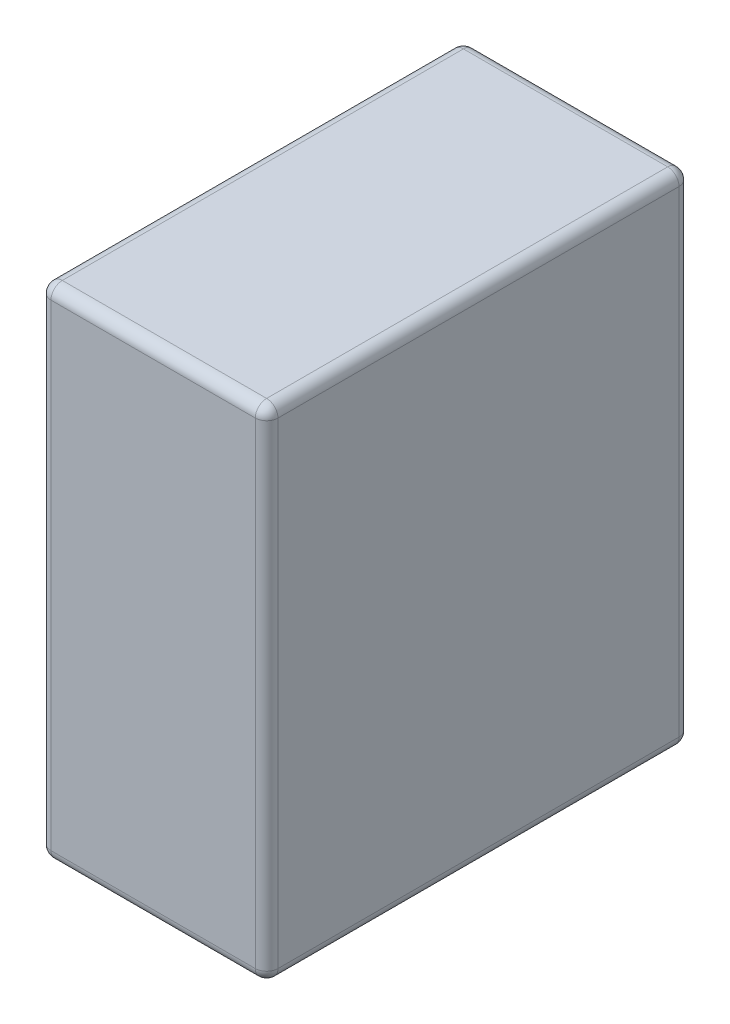
ISO-10303-21;
HEADER;
FILE_DESCRIPTION(('STEP AP214'),'2;1');
FILE_NAME('part.step','',(''),(''),'','','');
FILE_SCHEMA(('AUTOMOTIVE_DESIGN { 1 0 10303 214 1 1 1 1 }'));
ENDSEC;
DATA;
#1=APPLICATION_CONTEXT('core data for automotive mechanical design processes');
#2=APPLICATION_PROTOCOL_DEFINITION('international standard','automotive_design',2000,#1);
#3=PRODUCT_CONTEXT('',#1,'mechanical');
#4=PRODUCT('Part','Part','',(#3));
#5=PRODUCT_RELATED_PRODUCT_CATEGORY('part','',(#4));
#6=PRODUCT_DEFINITION_FORMATION('','',#4);
#7=PRODUCT_DEFINITION_CONTEXT('part definition',#1,'design');
#8=PRODUCT_DEFINITION('design','',#6,#7);
#9=PRODUCT_DEFINITION_SHAPE('','',#8);
#10=(LENGTH_UNIT() NAMED_UNIT(*) SI_UNIT(.MILLI.,.METRE.));
#11=(NAMED_UNIT(*) PLANE_ANGLE_UNIT() SI_UNIT($,.RADIAN.));
#12=(NAMED_UNIT(*) SI_UNIT($,.STERADIAN.) SOLID_ANGLE_UNIT());
#13=UNCERTAINTY_MEASURE_WITH_UNIT(LENGTH_MEASURE(1.E-05),#10,'distance_accuracy_value','');
#14=(GEOMETRIC_REPRESENTATION_CONTEXT(3) GLOBAL_UNCERTAINTY_ASSIGNED_CONTEXT((#13)) GLOBAL_UNIT_ASSIGNED_CONTEXT((#10,
#11,#12)) REPRESENTATION_CONTEXT('',''));
#15=CARTESIAN_POINT('',(0.,0.,0.));
#16=DIRECTION('',(0.,0.,1.));
#17=DIRECTION('',(1.,0.,0.));
#18=AXIS2_PLACEMENT_3D('',#15,#16,#17);
#19=CARTESIAN_POINT('',(-15.,66.,28.));
#20=DIRECTION('',(1.,0.,0.));
#21=DIRECTION('',(0.,0.,-1.));
#22=AXIS2_PLACEMENT_3D('',#19,#20,#21);
#23=PLANE('',#22);
#24=DIRECTION('',(0.,-1.,0.));
#25=VECTOR('',#24,1.);
#26=CARTESIAN_POINT('',(-15.,66.,-26.5));
#27=LINE('',#26,#25);
#28=CARTESIAN_POINT('',(-15.,64.5,-26.5));
#29=VERTEX_POINT('',#28);
#30=CARTESIAN_POINT('',(-15.,1.5,-26.5));
#31=VERTEX_POINT('',#30);
#32=EDGE_CURVE('E144',#29,#31,#27,.T.);
#33=ORIENTED_EDGE('',*,*,#32,.T.);
#34=DIRECTION('',(0.,0.,1.));
#35=VECTOR('',#34,1.);
#36=CARTESIAN_POINT('',(-15.,1.5,28.));
#37=LINE('',#36,#35);
#38=CARTESIAN_POINT('',(-15.,1.5,26.5));
#39=VERTEX_POINT('',#38);
#40=EDGE_CURVE('E139',#31,#39,#37,.T.);
#41=ORIENTED_EDGE('',*,*,#40,.T.);
#42=DIRECTION('',(0.,-1.,0.));
#43=VECTOR('',#42,1.);
#44=CARTESIAN_POINT('',(-15.,66.,26.5));
#45=LINE('',#44,#43);
#46=CARTESIAN_POINT('',(-15.,64.5,26.5));
#47=VERTEX_POINT('',#46);
#48=EDGE_CURVE('E134',#39,#47,#45,.F.);
#49=ORIENTED_EDGE('',*,*,#48,.T.);
#50=DIRECTION('',(0.,0.,1.));
#51=VECTOR('',#50,1.);
#52=CARTESIAN_POINT('',(-15.,64.5,-28.));
#53=LINE('',#52,#51);
#54=EDGE_CURVE('E136',#47,#29,#53,.F.);
#55=ORIENTED_EDGE('',*,*,#54,.T.);
#56=EDGE_LOOP('',(#33,#41,#49,#55));
#57=FACE_BOUND('',#56,.T.);
#58=ADVANCED_FACE('F45',(#57),#23,.F.);
#59=CARTESIAN_POINT('',(15.,66.,28.));
#60=DIRECTION('',(0.,0.,-1.));
#61=DIRECTION('',(-1.,0.,0.));
#62=AXIS2_PLACEMENT_3D('',#59,#60,#61);
#63=PLANE('',#62);
#64=DIRECTION('',(0.,-1.,0.));
#65=VECTOR('',#64,1.);
#66=CARTESIAN_POINT('',(-13.5,66.,28.));
#67=LINE('',#66,#65);
#68=CARTESIAN_POINT('',(-13.5,64.5,28.));
#69=VERTEX_POINT('',#68);
#70=CARTESIAN_POINT('',(-13.5,1.5,28.));
#71=VERTEX_POINT('',#70);
#72=EDGE_CURVE('E168',#69,#71,#67,.T.);
#73=ORIENTED_EDGE('',*,*,#72,.T.);
#74=DIRECTION('',(1.,0.,0.));
#75=VECTOR('',#74,1.);
#76=CARTESIAN_POINT('',(15.,1.5,28.));
#77=LINE('',#76,#75);
#78=CARTESIAN_POINT('',(13.5,1.5,28.));
#79=VERTEX_POINT('',#78);
#80=EDGE_CURVE('E269',#71,#79,#77,.T.);
#81=ORIENTED_EDGE('',*,*,#80,.T.);
#82=DIRECTION('',(0.,-1.,0.));
#83=VECTOR('',#82,1.);
#84=CARTESIAN_POINT('',(13.5,66.,28.));
#85=LINE('',#84,#83);
#86=CARTESIAN_POINT('',(13.5,64.5,28.));
#87=VERTEX_POINT('',#86);
#88=EDGE_CURVE('E260',#79,#87,#85,.F.);
#89=ORIENTED_EDGE('',*,*,#88,.T.);
#90=DIRECTION('',(1.,0.,0.));
#91=VECTOR('',#90,1.);
#92=CARTESIAN_POINT('',(-15.,64.5,28.));
#93=LINE('',#92,#91);
#94=EDGE_CURVE('E256',#87,#69,#93,.F.);
#95=ORIENTED_EDGE('',*,*,#94,.T.);
#96=EDGE_LOOP('',(#73,#81,#89,#95));
#97=FACE_BOUND('',#96,.T.);
#98=ADVANCED_FACE('F380',(#97),#63,.F.);
#99=CARTESIAN_POINT('',(15.,66.,28.));
#100=DIRECTION('',(-1.,0.,0.));
#101=DIRECTION('',(0.,0.,1.));
#102=AXIS2_PLACEMENT_3D('',#99,#100,#101);
#103=PLANE('',#102);
#104=DIRECTION('',(0.,0.,-1.));
#105=VECTOR('',#104,1.);
#106=CARTESIAN_POINT('',(15.,1.5,28.));
#107=LINE('',#106,#105);
#108=CARTESIAN_POINT('',(15.,1.5,26.5));
#109=VERTEX_POINT('',#108);
#110=CARTESIAN_POINT('',(15.,1.5,-26.5));
#111=VERTEX_POINT('',#110);
#112=EDGE_CURVE('E251',#109,#111,#107,.T.);
#113=ORIENTED_EDGE('',*,*,#112,.T.);
#114=DIRECTION('',(0.,-1.,0.));
#115=VECTOR('',#114,1.);
#116=CARTESIAN_POINT('',(15.,66.,-26.5));
#117=LINE('',#116,#115);
#118=CARTESIAN_POINT('',(15.,64.5,-26.5));
#119=VERTEX_POINT('',#118);
#120=EDGE_CURVE('E248',#111,#119,#117,.F.);
#121=ORIENTED_EDGE('',*,*,#120,.T.);
#122=DIRECTION('',(0.,0.,-1.));
#123=VECTOR('',#122,1.);
#124=CARTESIAN_POINT('',(15.,64.5,28.));
#125=LINE('',#124,#123);
#126=CARTESIAN_POINT('',(15.,64.5,26.5));
#127=VERTEX_POINT('',#126);
#128=EDGE_CURVE('E240',#119,#127,#125,.F.);
#129=ORIENTED_EDGE('',*,*,#128,.T.);
#130=DIRECTION('',(0.,-1.,0.));
#131=VECTOR('',#130,1.);
#132=CARTESIAN_POINT('',(15.,66.,26.5));
#133=LINE('',#132,#131);
#134=EDGE_CURVE('E244',#127,#109,#133,.T.);
#135=ORIENTED_EDGE('',*,*,#134,.T.);
#136=EDGE_LOOP('',(#113,#121,#129,#135));
#137=FACE_BOUND('',#136,.T.);
#138=ADVANCED_FACE('F249',(#137),#103,.F.);
#139=CARTESIAN_POINT('',(15.,66.,-28.));
#140=DIRECTION('',(0.,0.,1.));
#141=DIRECTION('',(1.,0.,0.));
#142=AXIS2_PLACEMENT_3D('',#139,#140,#141);
#143=PLANE('',#142);
#144=DIRECTION('',(-1.,0.,0.));
#145=VECTOR('',#144,1.);
#146=CARTESIAN_POINT('',(15.,1.5,-28.));
#147=LINE('',#146,#145);
#148=CARTESIAN_POINT('',(13.5,1.5,-28.));
#149=VERTEX_POINT('',#148);
#150=CARTESIAN_POINT('',(-13.5,1.5,-28.));
#151=VERTEX_POINT('',#150);
#152=EDGE_CURVE('E332',#149,#151,#147,.T.);
#153=ORIENTED_EDGE('',*,*,#152,.T.);
#154=DIRECTION('',(0.,-1.,0.));
#155=VECTOR('',#154,1.);
#156=CARTESIAN_POINT('',(-13.5,66.,-28.));
#157=LINE('',#156,#155);
#158=CARTESIAN_POINT('',(-13.5,64.5,-28.));
#159=VERTEX_POINT('',#158);
#160=EDGE_CURVE('E245',#151,#159,#157,.F.);
#161=ORIENTED_EDGE('',*,*,#160,.T.);
#162=DIRECTION('',(-1.,0.,0.));
#163=VECTOR('',#162,1.);
#164=CARTESIAN_POINT('',(15.,64.5,-28.));
#165=LINE('',#164,#163);
#166=CARTESIAN_POINT('',(13.5,64.5,-28.));
#167=VERTEX_POINT('',#166);
#168=EDGE_CURVE('E323',#159,#167,#165,.F.);
#169=ORIENTED_EDGE('',*,*,#168,.T.);
#170=DIRECTION('',(0.,-1.,0.));
#171=VECTOR('',#170,1.);
#172=CARTESIAN_POINT('',(13.5,66.,-28.));
#173=LINE('',#172,#171);
#174=EDGE_CURVE('E326',#167,#149,#173,.T.);
#175=ORIENTED_EDGE('',*,*,#174,.T.);
#176=EDGE_LOOP('',(#153,#161,#169,#175));
#177=FACE_BOUND('',#176,.T.);
#178=ADVANCED_FACE('F364',(#177),#143,.F.);
#179=CARTESIAN_POINT('',(0.,66.,0.));
#180=DIRECTION('',(0.,1.,0.));
#181=DIRECTION('',(0.,0.,1.));
#182=AXIS2_PLACEMENT_3D('',#179,#180,#181);
#183=PLANE('',#182);
#184=DIRECTION('',(0.,0.,-1.));
#185=VECTOR('',#184,1.);
#186=CARTESIAN_POINT('',(13.5,66.,-28.));
#187=LINE('',#186,#185);
#188=CARTESIAN_POINT('',(13.5,66.,26.5));
#189=VERTEX_POINT('',#188);
#190=CARTESIAN_POINT('',(13.5,66.,-26.5));
#191=VERTEX_POINT('',#190);
#192=EDGE_CURVE('E55',#189,#191,#187,.T.);
#193=ORIENTED_EDGE('',*,*,#192,.T.);
#194=DIRECTION('',(-1.,0.,0.));
#195=VECTOR('',#194,1.);
#196=CARTESIAN_POINT('',(-15.,66.,-26.5));
#197=LINE('',#196,#195);
#198=CARTESIAN_POINT('',(-13.5,66.,-26.5));
#199=VERTEX_POINT('',#198);
#200=EDGE_CURVE('E11',#191,#199,#197,.T.);
#201=ORIENTED_EDGE('',*,*,#200,.T.);
#202=DIRECTION('',(0.,0.,1.));
#203=VECTOR('',#202,1.);
#204=CARTESIAN_POINT('',(-13.5,66.,28.));
#205=LINE('',#204,#203);
#206=CARTESIAN_POINT('',(-13.5,66.,26.5));
#207=VERTEX_POINT('',#206);
#208=EDGE_CURVE('E272',#199,#207,#205,.T.);
#209=ORIENTED_EDGE('',*,*,#208,.T.);
#210=DIRECTION('',(1.,0.,0.));
#211=VECTOR('',#210,1.);
#212=CARTESIAN_POINT('',(15.,66.,26.5));
#213=LINE('',#212,#211);
#214=EDGE_CURVE('E66',#207,#189,#213,.T.);
#215=ORIENTED_EDGE('',*,*,#214,.T.);
#216=EDGE_LOOP('',(#193,#201,#209,#215));
#217=FACE_BOUND('',#216,.T.);
#218=ADVANCED_FACE('F603',(#217),#183,.T.);
#219=CARTESIAN_POINT('',(0.,0.,0.));
#220=DIRECTION('',(0.,1.,0.));
#221=DIRECTION('',(0.,0.,1.));
#222=AXIS2_PLACEMENT_3D('',#219,#220,#221);
#223=PLANE('',#222);
#224=DIRECTION('',(1.,0.,0.));
#225=VECTOR('',#224,1.);
#226=CARTESIAN_POINT('',(0.,0.,26.5));
#227=LINE('',#226,#225);
#228=CARTESIAN_POINT('',(13.5,0.,26.5));
#229=VERTEX_POINT('',#228);
#230=CARTESIAN_POINT('',(-13.5,0.,26.5));
#231=VERTEX_POINT('',#230);
#232=EDGE_CURVE('E318',#229,#231,#227,.F.);
#233=ORIENTED_EDGE('',*,*,#232,.T.);
#234=DIRECTION('',(0.,0.,1.));
#235=VECTOR('',#234,1.);
#236=CARTESIAN_POINT('',(-13.5,0.,0.));
#237=LINE('',#236,#235);
#238=CARTESIAN_POINT('',(-13.5,0.,-26.5));
#239=VERTEX_POINT('',#238);
#240=EDGE_CURVE('E312',#231,#239,#237,.F.);
#241=ORIENTED_EDGE('',*,*,#240,.T.);
#242=DIRECTION('',(-1.,0.,0.));
#243=VECTOR('',#242,1.);
#244=CARTESIAN_POINT('',(0.,0.,-26.5));
#245=LINE('',#244,#243);
#246=CARTESIAN_POINT('',(13.5,0.,-26.5));
#247=VERTEX_POINT('',#246);
#248=EDGE_CURVE('E305',#239,#247,#245,.F.);
#249=ORIENTED_EDGE('',*,*,#248,.T.);
#250=DIRECTION('',(0.,0.,-1.));
#251=VECTOR('',#250,1.);
#252=CARTESIAN_POINT('',(13.5,0.,0.));
#253=LINE('',#252,#251);
#254=EDGE_CURVE('E313',#247,#229,#253,.F.);
#255=ORIENTED_EDGE('',*,*,#254,.T.);
#256=EDGE_LOOP('',(#233,#241,#249,#255));
#257=FACE_BOUND('',#256,.T.);
#258=ADVANCED_FACE('F316',(#257),#223,.F.);
#259=CARTESIAN_POINT('',(13.5,64.5,0.));
#260=DIRECTION('',(0.,0.,1.));
#261=DIRECTION('',(1.,0.,0.));
#262=AXIS2_PLACEMENT_3D('',#259,#260,#261);
#263=CYLINDRICAL_SURFACE('',#262,1.5);
#264=CARTESIAN_POINT('',(13.5,64.5,-26.5));
#265=DIRECTION('',(0.,0.,-1.));
#266=DIRECTION('',(-1.,0.,0.));
#267=AXIS2_PLACEMENT_3D('',#264,#265,#266);
#268=CIRCLE('',#267,1.5);
#269=EDGE_CURVE('E49',#191,#119,#268,.T.);
#270=ORIENTED_EDGE('',*,*,#269,.F.);
#271=ORIENTED_EDGE('',*,*,#192,.F.);
#272=CARTESIAN_POINT('',(13.5,64.5,26.5));
#273=DIRECTION('',(0.,0.,1.));
#274=DIRECTION('',(1.,0.,0.));
#275=AXIS2_PLACEMENT_3D('',#272,#273,#274);
#276=CIRCLE('',#275,1.5);
#277=EDGE_CURVE('E223',#127,#189,#276,.T.);
#278=ORIENTED_EDGE('',*,*,#277,.F.);
#279=ORIENTED_EDGE('',*,*,#128,.F.);
#280=EDGE_LOOP('',(#270,#271,#278,#279));
#281=FACE_BOUND('',#280,.T.);
#282=ADVANCED_FACE('F47',(#281),#263,.T.);
#283=CARTESIAN_POINT('',(13.5,64.5,-26.5));
#284=DIRECTION('',(1.,0.,0.));
#285=DIRECTION('',(0.,0.,-1.));
#286=AXIS2_PLACEMENT_3D('',#283,#284,#285);
#287=SPHERICAL_SURFACE('',#286,1.5);
#288=CARTESIAN_POINT('',(13.5,64.5,-26.5));
#289=DIRECTION('',(1.,0.,0.));
#290=DIRECTION('',(0.,0.,-1.));
#291=AXIS2_PLACEMENT_3D('',#288,#289,#290);
#292=CIRCLE('',#291,1.5);
#293=EDGE_CURVE('E217',#191,#167,#292,.F.);
#294=ORIENTED_EDGE('',*,*,#293,.F.);
#295=ORIENTED_EDGE('',*,*,#269,.T.);
#296=CARTESIAN_POINT('',(13.5,64.5,-26.5));
#297=DIRECTION('',(0.,1.,0.));
#298=DIRECTION('',(0.,0.,1.));
#299=AXIS2_PLACEMENT_3D('',#296,#297,#298);
#300=CIRCLE('',#299,1.5);
#301=EDGE_CURVE('E221',#167,#119,#300,.F.);
#302=ORIENTED_EDGE('',*,*,#301,.F.);
#303=EDGE_LOOP('',(#294,#295,#302));
#304=FACE_BOUND('',#303,.T.);
#305=ADVANCED_FACE('F236',(#304),#287,.T.);
#306=CARTESIAN_POINT('',(13.5,64.5,26.5));
#307=DIRECTION('',(0.,1.,0.));
#308=DIRECTION('',(0.,0.,1.));
#309=AXIS2_PLACEMENT_3D('',#306,#307,#308);
#310=SPHERICAL_SURFACE('',#309,1.5);
#311=CARTESIAN_POINT('',(13.5,64.5,26.5));
#312=DIRECTION('',(0.,1.,0.));
#313=DIRECTION('',(0.,0.,1.));
#314=AXIS2_PLACEMENT_3D('',#311,#312,#313);
#315=CIRCLE('',#314,1.5);
#316=EDGE_CURVE('E209',#127,#87,#315,.F.);
#317=ORIENTED_EDGE('',*,*,#316,.F.);
#318=ORIENTED_EDGE('',*,*,#277,.T.);
#319=CARTESIAN_POINT('',(13.5,64.5,26.5));
#320=DIRECTION('',(1.,0.,0.));
#321=DIRECTION('',(0.,0.,-1.));
#322=AXIS2_PLACEMENT_3D('',#319,#320,#321);
#323=CIRCLE('',#322,1.5);
#324=EDGE_CURVE('E213',#87,#189,#323,.F.);
#325=ORIENTED_EDGE('',*,*,#324,.F.);
#326=EDGE_LOOP('',(#317,#318,#325));
#327=FACE_BOUND('',#326,.T.);
#328=ADVANCED_FACE('F564',(#327),#310,.T.);
#329=CARTESIAN_POINT('',(13.5,66.,-26.5));
#330=DIRECTION('',(0.,-1.,0.));
#331=DIRECTION('',(0.,0.,-1.));
#332=AXIS2_PLACEMENT_3D('',#329,#330,#331);
#333=CYLINDRICAL_SURFACE('',#332,1.5);
#334=ORIENTED_EDGE('',*,*,#301,.T.);
#335=ORIENTED_EDGE('',*,*,#120,.F.);
#336=CARTESIAN_POINT('',(13.5,1.5,-26.5));
#337=DIRECTION('',(0.,-1.,0.));
#338=DIRECTION('',(0.,0.,-1.));
#339=AXIS2_PLACEMENT_3D('',#336,#337,#338);
#340=CIRCLE('',#339,1.5);
#341=EDGE_CURVE('E201',#149,#111,#340,.T.);
#342=ORIENTED_EDGE('',*,*,#341,.F.);
#343=ORIENTED_EDGE('',*,*,#174,.F.);
#344=EDGE_LOOP('',(#334,#335,#342,#343));
#345=FACE_BOUND('',#344,.T.);
#346=ADVANCED_FACE('F366',(#345),#333,.T.);
#347=CARTESIAN_POINT('',(0.,64.5,-26.5));
#348=DIRECTION('',(1.,0.,0.));
#349=DIRECTION('',(0.,0.,-1.));
#350=AXIS2_PLACEMENT_3D('',#347,#348,#349);
#351=CYLINDRICAL_SURFACE('',#350,1.5);
#352=ORIENTED_EDGE('',*,*,#293,.T.);
#353=ORIENTED_EDGE('',*,*,#168,.F.);
#354=CARTESIAN_POINT('',(-13.5,64.5,-26.5));
#355=DIRECTION('',(-1.,0.,0.));
#356=DIRECTION('',(0.,0.,1.));
#357=AXIS2_PLACEMENT_3D('',#354,#355,#356);
#358=CIRCLE('',#357,1.5);
#359=EDGE_CURVE('E197',#199,#159,#358,.T.);
#360=ORIENTED_EDGE('',*,*,#359,.F.);
#361=ORIENTED_EDGE('',*,*,#200,.F.);
#362=EDGE_LOOP('',(#352,#353,#360,#361));
#363=FACE_BOUND('',#362,.T.);
#364=ADVANCED_FACE('F542',(#363),#351,.T.);
#365=CARTESIAN_POINT('',(-13.5,64.5,0.));
#366=DIRECTION('',(0.,0.,-1.));
#367=DIRECTION('',(-1.,0.,0.));
#368=AXIS2_PLACEMENT_3D('',#365,#366,#367);
#369=CYLINDRICAL_SURFACE('',#368,1.5);
#370=CARTESIAN_POINT('',(-13.5,64.5,26.5));
#371=DIRECTION('',(0.,0.,1.));
#372=DIRECTION('',(1.,0.,0.));
#373=AXIS2_PLACEMENT_3D('',#370,#371,#372);
#374=CIRCLE('',#373,1.5);
#375=EDGE_CURVE('E151',#207,#47,#374,.T.);
#376=ORIENTED_EDGE('',*,*,#375,.F.);
#377=ORIENTED_EDGE('',*,*,#208,.F.);
#378=CARTESIAN_POINT('',(-13.5,64.5,-26.5));
#379=DIRECTION('',(0.,0.,-1.));
#380=DIRECTION('',(0.,1.,0.));
#381=AXIS2_PLACEMENT_3D('',#378,#379,#380);
#382=CIRCLE('',#381,1.5);
#383=EDGE_CURVE('E153',#29,#199,#382,.T.);
#384=ORIENTED_EDGE('',*,*,#383,.F.);
#385=ORIENTED_EDGE('',*,*,#54,.F.);
#386=EDGE_LOOP('',(#376,#377,#384,#385));
#387=FACE_BOUND('',#386,.T.);
#388=ADVANCED_FACE('F149',(#387),#369,.T.);
#389=CARTESIAN_POINT('',(0.,64.5,26.5));
#390=DIRECTION('',(-1.,0.,0.));
#391=DIRECTION('',(0.,0.,1.));
#392=AXIS2_PLACEMENT_3D('',#389,#390,#391);
#393=CYLINDRICAL_SURFACE('',#392,1.5);
#394=ORIENTED_EDGE('',*,*,#324,.T.);
#395=ORIENTED_EDGE('',*,*,#214,.F.);
#396=CARTESIAN_POINT('',(-13.5,64.5,26.5));
#397=DIRECTION('',(-1.,0.,0.));
#398=DIRECTION('',(0.,-1.,0.));
#399=AXIS2_PLACEMENT_3D('',#396,#397,#398);
#400=CIRCLE('',#399,1.5);
#401=EDGE_CURVE('E163',#69,#207,#400,.T.);
#402=ORIENTED_EDGE('',*,*,#401,.F.);
#403=ORIENTED_EDGE('',*,*,#94,.F.);
#404=EDGE_LOOP('',(#394,#395,#402,#403));
#405=FACE_BOUND('',#404,.T.);
#406=ADVANCED_FACE('F520',(#405),#393,.T.);
#407=CARTESIAN_POINT('',(13.5,66.,26.5));
#408=DIRECTION('',(0.,-1.,0.));
#409=DIRECTION('',(0.,0.,-1.));
#410=AXIS2_PLACEMENT_3D('',#407,#408,#409);
#411=CYLINDRICAL_SURFACE('',#410,1.5);
#412=ORIENTED_EDGE('',*,*,#316,.T.);
#413=ORIENTED_EDGE('',*,*,#88,.F.);
#414=CARTESIAN_POINT('',(13.5,1.5,26.5));
#415=DIRECTION('',(0.,-1.,0.));
#416=DIRECTION('',(0.,0.,-1.));
#417=AXIS2_PLACEMENT_3D('',#414,#415,#416);
#418=CIRCLE('',#417,1.5);
#419=EDGE_CURVE('E189',#109,#79,#418,.T.);
#420=ORIENTED_EDGE('',*,*,#419,.F.);
#421=ORIENTED_EDGE('',*,*,#134,.F.);
#422=EDGE_LOOP('',(#412,#413,#420,#421));
#423=FACE_BOUND('',#422,.T.);
#424=ADVANCED_FACE('F346',(#423),#411,.T.);
#425=CARTESIAN_POINT('',(13.5,1.5,28.));
#426=DIRECTION('',(0.,0.,-1.));
#427=DIRECTION('',(-1.,0.,0.));
#428=AXIS2_PLACEMENT_3D('',#425,#426,#427);
#429=CYLINDRICAL_SURFACE('',#428,1.5);
#430=CARTESIAN_POINT('',(13.5,1.5,-26.5));
#431=DIRECTION('',(0.,0.,-1.));
#432=DIRECTION('',(-1.,0.,0.));
#433=AXIS2_PLACEMENT_3D('',#430,#431,#432);
#434=CIRCLE('',#433,1.5);
#435=EDGE_CURVE('E205',#111,#247,#434,.T.);
#436=ORIENTED_EDGE('',*,*,#435,.F.);
#437=ORIENTED_EDGE('',*,*,#112,.F.);
#438=CARTESIAN_POINT('',(13.5,1.5,26.5));
#439=DIRECTION('',(0.,0.,1.));
#440=DIRECTION('',(1.,0.,0.));
#441=AXIS2_PLACEMENT_3D('',#438,#439,#440);
#442=CIRCLE('',#441,1.5);
#443=EDGE_CURVE('E185',#229,#109,#442,.T.);
#444=ORIENTED_EDGE('',*,*,#443,.F.);
#445=ORIENTED_EDGE('',*,*,#254,.F.);
#446=EDGE_LOOP('',(#436,#437,#444,#445));
#447=FACE_BOUND('',#446,.T.);
#448=ADVANCED_FACE('F343',(#447),#429,.T.);
#449=CARTESIAN_POINT('',(13.5,1.5,-26.5));
#450=DIRECTION('',(1.,0.,0.));
#451=DIRECTION('',(0.,1.,0.));
#452=AXIS2_PLACEMENT_3D('',#449,#450,#451);
#453=SPHERICAL_SURFACE('',#452,1.5);
#454=ORIENTED_EDGE('',*,*,#341,.T.);
#455=ORIENTED_EDGE('',*,*,#435,.T.);
#456=CARTESIAN_POINT('',(13.5,1.5,-26.5));
#457=DIRECTION('',(1.,0.,0.));
#458=DIRECTION('',(0.,0.,-1.));
#459=AXIS2_PLACEMENT_3D('',#456,#457,#458);
#460=CIRCLE('',#459,1.5);
#461=EDGE_CURVE('E175',#149,#247,#460,.F.);
#462=ORIENTED_EDGE('',*,*,#461,.F.);
#463=EDGE_LOOP('',(#454,#455,#462));
#464=FACE_BOUND('',#463,.T.);
#465=ADVANCED_FACE('F368',(#464),#453,.T.);
#466=CARTESIAN_POINT('',(-13.5,64.5,-26.5));
#467=DIRECTION('',(0.,1.,0.));
#468=DIRECTION('',(0.,0.,1.));
#469=AXIS2_PLACEMENT_3D('',#466,#467,#468);
#470=SPHERICAL_SURFACE('',#469,1.5);
#471=ORIENTED_EDGE('',*,*,#383,.T.);
#472=ORIENTED_EDGE('',*,*,#359,.T.);
#473=CARTESIAN_POINT('',(-13.5,64.5,-26.5));
#474=DIRECTION('',(0.,1.,0.));
#475=DIRECTION('',(0.,0.,1.));
#476=AXIS2_PLACEMENT_3D('',#473,#474,#475);
#477=CIRCLE('',#476,1.5);
#478=EDGE_CURVE('E170',#29,#159,#477,.F.);
#479=ORIENTED_EDGE('',*,*,#478,.F.);
#480=EDGE_LOOP('',(#471,#472,#479));
#481=FACE_BOUND('',#480,.T.);
#482=ADVANCED_FACE('F370',(#481),#470,.T.);
#483=CARTESIAN_POINT('',(-13.5,64.5,26.5));
#484=DIRECTION('',(0.,1.,0.));
#485=DIRECTION('',(0.,0.,1.));
#486=AXIS2_PLACEMENT_3D('',#483,#484,#485);
#487=SPHERICAL_SURFACE('',#486,1.5);
#488=ORIENTED_EDGE('',*,*,#401,.T.);
#489=ORIENTED_EDGE('',*,*,#375,.T.);
#490=CARTESIAN_POINT('',(-13.5,64.5,26.5));
#491=DIRECTION('',(0.,1.,0.));
#492=DIRECTION('',(0.,0.,1.));
#493=AXIS2_PLACEMENT_3D('',#490,#491,#492);
#494=CIRCLE('',#493,1.5);
#495=EDGE_CURVE('E160',#69,#47,#494,.F.);
#496=ORIENTED_EDGE('',*,*,#495,.F.);
#497=EDGE_LOOP('',(#488,#489,#496));
#498=FACE_BOUND('',#497,.T.);
#499=ADVANCED_FACE('F159',(#498),#487,.T.);
#500=CARTESIAN_POINT('',(13.5,1.5,26.5));
#501=DIRECTION('',(1.,0.,0.));
#502=DIRECTION('',(0.,1.,0.));
#503=AXIS2_PLACEMENT_3D('',#500,#501,#502);
#504=SPHERICAL_SURFACE('',#503,1.5);
#505=ORIENTED_EDGE('',*,*,#443,.T.);
#506=ORIENTED_EDGE('',*,*,#419,.T.);
#507=CARTESIAN_POINT('',(13.5,1.5,26.5));
#508=DIRECTION('',(1.,0.,0.));
#509=DIRECTION('',(0.,0.,-1.));
#510=AXIS2_PLACEMENT_3D('',#507,#508,#509);
#511=CIRCLE('',#510,1.5);
#512=EDGE_CURVE('E171',#229,#79,#511,.F.);
#513=ORIENTED_EDGE('',*,*,#512,.F.);
#514=EDGE_LOOP('',(#505,#506,#513));
#515=FACE_BOUND('',#514,.T.);
#516=ADVANCED_FACE('F348',(#515),#504,.T.);
#517=CARTESIAN_POINT('',(15.,1.5,-26.5));
#518=DIRECTION('',(-1.,0.,0.));
#519=DIRECTION('',(0.,0.,1.));
#520=AXIS2_PLACEMENT_3D('',#517,#518,#519);
#521=CYLINDRICAL_SURFACE('',#520,1.5);
#522=ORIENTED_EDGE('',*,*,#461,.T.);
#523=ORIENTED_EDGE('',*,*,#248,.F.);
#524=CARTESIAN_POINT('',(-13.5,1.5,-26.5));
#525=DIRECTION('',(-1.,0.,0.));
#526=DIRECTION('',(0.,0.,1.));
#527=AXIS2_PLACEMENT_3D('',#524,#525,#526);
#528=CIRCLE('',#527,1.5);
#529=EDGE_CURVE('E178',#151,#239,#528,.T.);
#530=ORIENTED_EDGE('',*,*,#529,.F.);
#531=ORIENTED_EDGE('',*,*,#152,.F.);
#532=EDGE_LOOP('',(#522,#523,#530,#531));
#533=FACE_BOUND('',#532,.T.);
#534=ADVANCED_FACE('F307',(#533),#521,.T.);
#535=CARTESIAN_POINT('',(-13.5,66.,-26.5));
#536=DIRECTION('',(0.,-1.,0.));
#537=DIRECTION('',(0.,0.,-1.));
#538=AXIS2_PLACEMENT_3D('',#535,#536,#537);
#539=CYLINDRICAL_SURFACE('',#538,1.5);
#540=ORIENTED_EDGE('',*,*,#478,.T.);
#541=ORIENTED_EDGE('',*,*,#160,.F.);
#542=CARTESIAN_POINT('',(-13.5,1.5,-26.5));
#543=DIRECTION('',(0.,-1.,0.));
#544=DIRECTION('',(0.,0.,-1.));
#545=AXIS2_PLACEMENT_3D('',#542,#543,#544);
#546=CIRCLE('',#545,1.5);
#547=EDGE_CURVE('E292',#31,#151,#546,.T.);
#548=ORIENTED_EDGE('',*,*,#547,.F.);
#549=ORIENTED_EDGE('',*,*,#32,.F.);
#550=EDGE_LOOP('',(#540,#541,#548,#549));
#551=FACE_BOUND('',#550,.T.);
#552=ADVANCED_FACE('F362',(#551),#539,.T.);
#553=CARTESIAN_POINT('',(-13.5,66.,26.5));
#554=DIRECTION('',(0.,-1.,0.));
#555=DIRECTION('',(0.,0.,-1.));
#556=AXIS2_PLACEMENT_3D('',#553,#554,#555);
#557=CYLINDRICAL_SURFACE('',#556,1.5);
#558=ORIENTED_EDGE('',*,*,#495,.T.);
#559=ORIENTED_EDGE('',*,*,#48,.F.);
#560=CARTESIAN_POINT('',(-13.5,1.5,26.5));
#561=DIRECTION('',(0.,-1.,0.));
#562=DIRECTION('',(0.,0.,-1.));
#563=AXIS2_PLACEMENT_3D('',#560,#561,#562);
#564=CIRCLE('',#563,1.5);
#565=EDGE_CURVE('E288',#71,#39,#564,.T.);
#566=ORIENTED_EDGE('',*,*,#565,.F.);
#567=ORIENTED_EDGE('',*,*,#72,.F.);
#568=EDGE_LOOP('',(#558,#559,#566,#567));
#569=FACE_BOUND('',#568,.T.);
#570=ADVANCED_FACE('F166',(#569),#557,.T.);
#571=CARTESIAN_POINT('',(15.,1.5,26.5));
#572=DIRECTION('',(1.,0.,0.));
#573=DIRECTION('',(0.,0.,-1.));
#574=AXIS2_PLACEMENT_3D('',#571,#572,#573);
#575=CYLINDRICAL_SURFACE('',#574,1.5);
#576=ORIENTED_EDGE('',*,*,#512,.T.);
#577=ORIENTED_EDGE('',*,*,#80,.F.);
#578=CARTESIAN_POINT('',(-13.5,1.5,26.5));
#579=DIRECTION('',(-1.,0.,0.));
#580=DIRECTION('',(0.,0.,1.));
#581=AXIS2_PLACEMENT_3D('',#578,#579,#580);
#582=CIRCLE('',#581,1.5);
#583=EDGE_CURVE('E285',#231,#71,#582,.T.);
#584=ORIENTED_EDGE('',*,*,#583,.F.);
#585=ORIENTED_EDGE('',*,*,#232,.F.);
#586=EDGE_LOOP('',(#576,#577,#584,#585));
#587=FACE_BOUND('',#586,.T.);
#588=ADVANCED_FACE('F351',(#587),#575,.T.);
#589=CARTESIAN_POINT('',(-13.5,1.5,-26.5));
#590=DIRECTION('',(0.,0.,-1.));
#591=DIRECTION('',(0.,1.,0.));
#592=AXIS2_PLACEMENT_3D('',#589,#590,#591);
#593=SPHERICAL_SURFACE('',#592,1.5);
#594=ORIENTED_EDGE('',*,*,#547,.T.);
#595=ORIENTED_EDGE('',*,*,#529,.T.);
#596=CARTESIAN_POINT('',(-13.5,1.5,-26.5));
#597=DIRECTION('',(0.,0.,-1.));
#598=DIRECTION('',(-1.,0.,0.));
#599=AXIS2_PLACEMENT_3D('',#596,#597,#598);
#600=CIRCLE('',#599,1.5);
#601=EDGE_CURVE('E282',#31,#239,#600,.F.);
#602=ORIENTED_EDGE('',*,*,#601,.F.);
#603=EDGE_LOOP('',(#594,#595,#602));
#604=FACE_BOUND('',#603,.T.);
#605=ADVANCED_FACE('F301',(#604),#593,.T.);
#606=CARTESIAN_POINT('',(-13.5,1.5,26.5));
#607=DIRECTION('',(0.,0.,1.));
#608=DIRECTION('',(1.,0.,0.));
#609=AXIS2_PLACEMENT_3D('',#606,#607,#608);
#610=SPHERICAL_SURFACE('',#609,1.5);
#611=ORIENTED_EDGE('',*,*,#583,.T.);
#612=ORIENTED_EDGE('',*,*,#565,.T.);
#613=CARTESIAN_POINT('',(-13.5,1.5,26.5));
#614=DIRECTION('',(0.,0.,1.));
#615=DIRECTION('',(1.,0.,0.));
#616=AXIS2_PLACEMENT_3D('',#613,#614,#615);
#617=CIRCLE('',#616,1.5);
#618=EDGE_CURVE('E279',#231,#39,#617,.F.);
#619=ORIENTED_EDGE('',*,*,#618,.F.);
#620=EDGE_LOOP('',(#611,#612,#619));
#621=FACE_BOUND('',#620,.T.);
#622=ADVANCED_FACE('F392',(#621),#610,.T.);
#623=CARTESIAN_POINT('',(-13.5,1.5,28.));
#624=DIRECTION('',(0.,0.,1.));
#625=DIRECTION('',(1.,0.,0.));
#626=AXIS2_PLACEMENT_3D('',#623,#624,#625);
#627=CYLINDRICAL_SURFACE('',#626,1.5);
#628=ORIENTED_EDGE('',*,*,#601,.T.);
#629=ORIENTED_EDGE('',*,*,#240,.F.);
#630=ORIENTED_EDGE('',*,*,#618,.T.);
#631=ORIENTED_EDGE('',*,*,#40,.F.);
#632=EDGE_LOOP('',(#628,#629,#630,#631));
#633=FACE_BOUND('',#632,.T.);
#634=ADVANCED_FACE('F389',(#633),#627,.T.);
#635=CLOSED_SHELL('',(#58,#98,#138,#178,#218,#258,#282,#305,#328,#346,#364,#388,#406,#424,#448,
#465,#482,#499,#516,#534,#552,#570,#588,#605,#622,#634));
#636=MANIFOLD_SOLID_BREP('B2',#635);
#637=ADVANCED_BREP_SHAPE_REPRESENTATION('',(#18,#636),#14);
#638=SHAPE_DEFINITION_REPRESENTATION(#9,#637);
ENDSEC;
END-ISO-10303-21;
